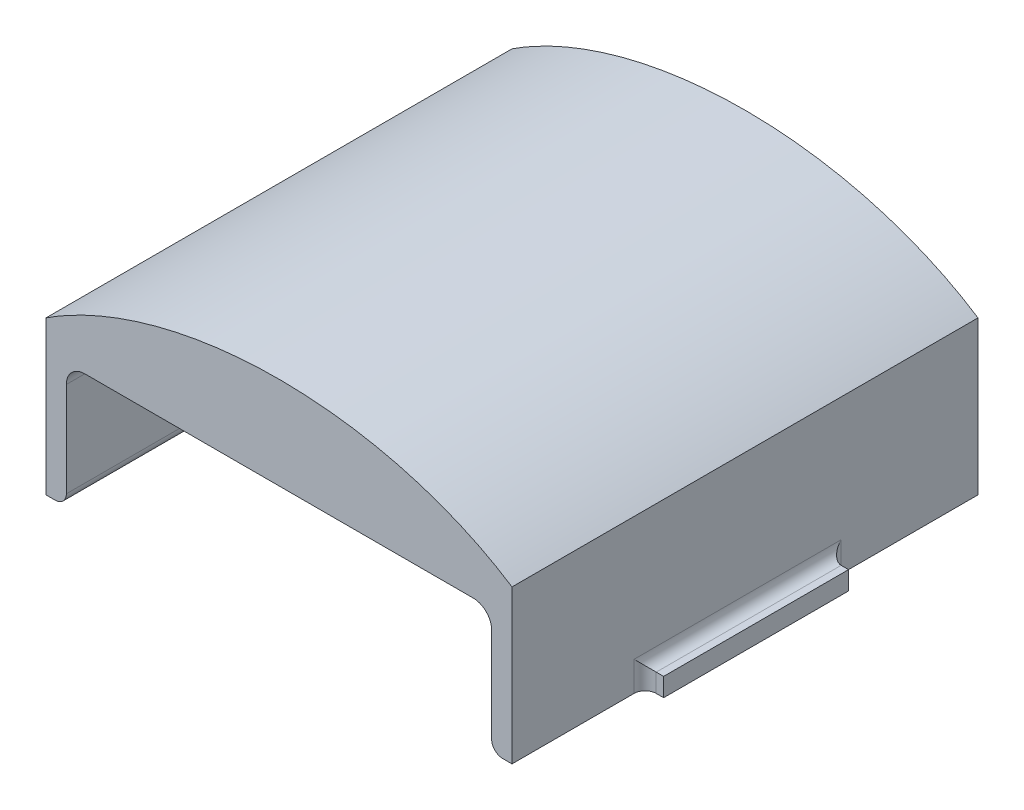
ISO-10303-21;
HEADER;
FILE_DESCRIPTION(('STEP AP214'),'2;1');
FILE_NAME('part.step','',(''),(''),'','','');
FILE_SCHEMA(('AUTOMOTIVE_DESIGN { 1 0 10303 214 1 1 1 1 }'));
ENDSEC;
DATA;
#1=APPLICATION_CONTEXT('core data for automotive mechanical design processes');
#2=APPLICATION_PROTOCOL_DEFINITION('international standard','automotive_design',2000,#1);
#3=PRODUCT_CONTEXT('',#1,'mechanical');
#4=PRODUCT('Part','Part','',(#3));
#5=PRODUCT_RELATED_PRODUCT_CATEGORY('part','',(#4));
#6=PRODUCT_DEFINITION_FORMATION('','',#4);
#7=PRODUCT_DEFINITION_CONTEXT('part definition',#1,'design');
#8=PRODUCT_DEFINITION('design','',#6,#7);
#9=PRODUCT_DEFINITION_SHAPE('','',#8);
#10=(LENGTH_UNIT() NAMED_UNIT(*) SI_UNIT(.MILLI.,.METRE.));
#11=(NAMED_UNIT(*) PLANE_ANGLE_UNIT() SI_UNIT($,.RADIAN.));
#12=(NAMED_UNIT(*) SI_UNIT($,.STERADIAN.) SOLID_ANGLE_UNIT());
#13=UNCERTAINTY_MEASURE_WITH_UNIT(LENGTH_MEASURE(1.E-05),#10,'distance_accuracy_value','');
#14=(GEOMETRIC_REPRESENTATION_CONTEXT(3) GLOBAL_UNCERTAINTY_ASSIGNED_CONTEXT((#13)) GLOBAL_UNIT_ASSIGNED_CONTEXT((#10,
#11,#12)) REPRESENTATION_CONTEXT('',''));
#15=CARTESIAN_POINT('',(0.,0.,0.));
#16=DIRECTION('',(0.,0.,1.));
#17=DIRECTION('',(1.,0.,0.));
#18=AXIS2_PLACEMENT_3D('',#15,#16,#17);
#19=CARTESIAN_POINT('',(-16.002,17.2485773582246,0.));
#20=DIRECTION('',(1.,0.,0.));
#21=DIRECTION('',(0.,1.,0.));
#22=AXIS2_PLACEMENT_3D('',#19,#20,#21);
#23=PLANE('',#22);
#24=DIRECTION('',(0.,0.,-1.));
#25=VECTOR('',#24,1.);
#26=CARTESIAN_POINT('',(-16.002,0.355599999999999,35.052));
#27=LINE('',#26,#25);
#28=CARTESIAN_POINT('',(-16.002,0.355599999999999,12.446));
#29=VERTEX_POINT('',#28);
#30=CARTESIAN_POINT('',(-16.002,0.355599999999999,3.048));
#31=VERTEX_POINT('',#30);
#32=EDGE_CURVE('E255',#29,#31,#27,.T.);
#33=ORIENTED_EDGE('',*,*,#32,.F.);
#34=DIRECTION('',(0.,-1.,0.));
#35=VECTOR('',#34,1.);
#36=CARTESIAN_POINT('',(-16.002,1.6256,12.446));
#37=LINE('',#36,#35);
#38=CARTESIAN_POINT('',(-16.002,2.3876,12.446));
#39=VERTEX_POINT('',#38);
#40=EDGE_CURVE('E413',#29,#39,#37,.F.);
#41=ORIENTED_EDGE('',*,*,#40,.T.);
#42=DIRECTION('',(0.,0.,-1.));
#43=VECTOR('',#42,1.);
#44=CARTESIAN_POINT('',(-16.002,2.3876,0.));
#45=LINE('',#44,#43);
#46=CARTESIAN_POINT('',(-16.002,2.3876,26.67));
#47=VERTEX_POINT('',#46);
#48=EDGE_CURVE('E411',#39,#47,#45,.F.);
#49=ORIENTED_EDGE('',*,*,#48,.T.);
#50=DIRECTION('',(0.,-1.,0.));
#51=VECTOR('',#50,1.);
#52=CARTESIAN_POINT('',(-16.002,17.2485773582246,26.67));
#53=LINE('',#52,#51);
#54=CARTESIAN_POINT('',(-16.002,0.355599999999999,26.67));
#55=VERTEX_POINT('',#54);
#56=EDGE_CURVE('E409',#47,#55,#53,.T.);
#57=ORIENTED_EDGE('',*,*,#56,.T.);
#58=CARTESIAN_POINT('',(-16.002,0.355599999999998,35.052));
#59=VERTEX_POINT('',#58);
#60=EDGE_CURVE('E264',#59,#55,#27,.T.);
#61=ORIENTED_EDGE('',*,*,#60,.F.);
#62=DIRECTION('',(0.,-1.,0.));
#63=VECTOR('',#62,1.);
#64=CARTESIAN_POINT('',(-16.002,17.2485773582246,35.052));
#65=LINE('',#64,#63);
#66=CARTESIAN_POINT('',(-16.002,10.8835369250993,35.052));
#67=VERTEX_POINT('',#66);
#68=EDGE_CURVE('E290',#67,#59,#65,.T.);
#69=ORIENTED_EDGE('',*,*,#68,.F.);
#70=DIRECTION('',(0.,0.,-1.));
#71=VECTOR('',#70,1.);
#72=CARTESIAN_POINT('',(-16.002,10.8835369250993,19.05));
#73=LINE('',#72,#71);
#74=CARTESIAN_POINT('',(-16.002,10.8835369250993,3.048));
#75=VERTEX_POINT('',#74);
#76=EDGE_CURVE('E275',#75,#67,#73,.F.);
#77=ORIENTED_EDGE('',*,*,#76,.F.);
#78=DIRECTION('',(0.,-1.,0.));
#79=VECTOR('',#78,1.);
#80=CARTESIAN_POINT('',(-16.002,17.2485773582246,3.048));
#81=LINE('',#80,#79);
#82=EDGE_CURVE('E287',#75,#31,#81,.T.);
#83=ORIENTED_EDGE('',*,*,#82,.T.);
#84=EDGE_LOOP('',(#33,#41,#49,#57,#61,#69,#77,#83));
#85=FACE_BOUND('',#84,.T.);
#86=ADVANCED_FACE('F34',(#85),#23,.F.);
#87=CARTESIAN_POINT('',(14.605,8.89,2.53999999999999));
#88=DIRECTION('',(0.,1.,0.));
#89=DIRECTION('',(-1.,0.,0.));
#90=AXIS2_PLACEMENT_3D('',#87,#88,#89);
#91=PLANE('',#90);
#92=DIRECTION('',(-1.,0.,0.));
#93=VECTOR('',#92,1.);
#94=CARTESIAN_POINT('',(14.605,8.89,35.052));
#95=LINE('',#94,#93);
#96=CARTESIAN_POINT('',(13.335,8.89,35.052));
#97=VERTEX_POINT('',#96);
#98=CARTESIAN_POINT('',(-13.335,8.89,35.052));
#99=VERTEX_POINT('',#98);
#100=EDGE_CURVE('E262',#97,#99,#95,.T.);
#101=ORIENTED_EDGE('',*,*,#100,.T.);
#102=DIRECTION('',(0.,0.,1.));
#103=VECTOR('',#102,1.);
#104=CARTESIAN_POINT('',(-13.335,8.89,3.048));
#105=LINE('',#104,#103);
#106=CARTESIAN_POINT('',(-13.335,8.89,3.048));
#107=VERTEX_POINT('',#106);
#108=EDGE_CURVE('E450',#99,#107,#105,.F.);
#109=ORIENTED_EDGE('',*,*,#108,.T.);
#110=DIRECTION('',(-1.,0.,0.));
#111=VECTOR('',#110,1.);
#112=CARTESIAN_POINT('',(14.605,8.89,3.048));
#113=LINE('',#112,#111);
#114=CARTESIAN_POINT('',(13.335,8.89,3.048));
#115=VERTEX_POINT('',#114);
#116=EDGE_CURVE('E268',#115,#107,#113,.T.);
#117=ORIENTED_EDGE('',*,*,#116,.F.);
#118=DIRECTION('',(0.,0.,1.));
#119=VECTOR('',#118,1.);
#120=CARTESIAN_POINT('',(13.335,8.89,35.052));
#121=LINE('',#120,#119);
#122=EDGE_CURVE('E447',#115,#97,#121,.T.);
#123=ORIENTED_EDGE('',*,*,#122,.T.);
#124=EDGE_LOOP('',(#101,#109,#117,#123));
#125=FACE_BOUND('',#124,.T.);
#126=ADVANCED_FACE('F311',(#125),#91,.F.);
#127=CARTESIAN_POINT('',(0.,0.,45.72));
#128=DIRECTION('',(0.,0.,1.));
#129=DIRECTION('',(-1.,0.,0.));
#130=AXIS2_PLACEMENT_3D('',#127,#128,#129);
#131=ELLIPSE('',#130,22.86,15.24);
#132=DIRECTION('',(0.,0.,-1.));
#133=VECTOR('',#132,1.);
#134=SURFACE_OF_LINEAR_EXTRUSION('',#131,#133);
#135=DIRECTION('',(0.,0.,-1.));
#136=VECTOR('',#135,1.);
#137=CARTESIAN_POINT('',(16.002,10.8835369250993,19.05));
#138=LINE('',#137,#136);
#139=CARTESIAN_POINT('',(16.002,10.8835369250993,3.048));
#140=VERTEX_POINT('',#139);
#141=CARTESIAN_POINT('',(16.002,10.8835369250993,35.052));
#142=VERTEX_POINT('',#141);
#143=EDGE_CURVE('E277',#140,#142,#138,.F.);
#144=ORIENTED_EDGE('',*,*,#143,.F.);
#145=CARTESIAN_POINT('',(0.,0.,3.048));
#146=DIRECTION('',(0.,0.,1.));
#147=DIRECTION('',(-1.,0.,0.));
#148=AXIS2_PLACEMENT_3D('',#145,#146,#147);
#149=ELLIPSE('',#148,22.86,15.24);
#150=EDGE_CURVE('E272',#140,#75,#149,.T.);
#151=ORIENTED_EDGE('',*,*,#150,.T.);
#152=ORIENTED_EDGE('',*,*,#76,.T.);
#153=CARTESIAN_POINT('',(0.,0.,35.052));
#154=DIRECTION('',(0.,0.,1.));
#155=DIRECTION('',(-1.,0.,0.));
#156=AXIS2_PLACEMENT_3D('',#153,#154,#155);
#157=ELLIPSE('',#156,22.86,15.24);
#158=EDGE_CURVE('E281',#142,#67,#157,.T.);
#159=ORIENTED_EDGE('',*,*,#158,.F.);
#160=EDGE_LOOP('',(#144,#151,#152,#159));
#161=FACE_BOUND('',#160,.T.);
#162=ADVANCED_FACE('F306',(#161),#134,.F.);
#163=CARTESIAN_POINT('',(-14.605,-8.89,2.53999999999999));
#164=DIRECTION('',(-1.,0.,0.));
#165=DIRECTION('',(0.,0.,1.));
#166=AXIS2_PLACEMENT_3D('',#163,#164,#165);
#167=PLANE('',#166);
#168=DIRECTION('',(0.,-1.,0.));
#169=VECTOR('',#168,1.);
#170=CARTESIAN_POINT('',(-14.605,17.2485773582246,3.048));
#171=LINE('',#170,#169);
#172=CARTESIAN_POINT('',(-14.605,7.62,3.048));
#173=VERTEX_POINT('',#172);
#174=CARTESIAN_POINT('',(-14.605,1.1176,3.048));
#175=VERTEX_POINT('',#174);
#176=EDGE_CURVE('E276',#173,#175,#171,.T.);
#177=ORIENTED_EDGE('',*,*,#176,.F.);
#178=DIRECTION('',(0.,0.,1.));
#179=VECTOR('',#178,1.);
#180=CARTESIAN_POINT('',(-14.605,7.62,35.052));
#181=LINE('',#180,#179);
#182=CARTESIAN_POINT('',(-14.605,7.62,35.052));
#183=VERTEX_POINT('',#182);
#184=EDGE_CURVE('E444',#173,#183,#181,.T.);
#185=ORIENTED_EDGE('',*,*,#184,.T.);
#186=DIRECTION('',(0.,-1.,0.));
#187=VECTOR('',#186,1.);
#188=CARTESIAN_POINT('',(-14.605,17.2485773582246,35.052));
#189=LINE('',#188,#187);
#190=CARTESIAN_POINT('',(-14.605,1.1176,35.052));
#191=VERTEX_POINT('',#190);
#192=EDGE_CURVE('E271',#183,#191,#189,.T.);
#193=ORIENTED_EDGE('',*,*,#192,.T.);
#194=DIRECTION('',(0.,0.,-1.));
#195=VECTOR('',#194,1.);
#196=CARTESIAN_POINT('',(-14.605,1.1176,2.53999999999999));
#197=LINE('',#196,#195);
#198=EDGE_CURVE('E439',#191,#175,#197,.T.);
#199=ORIENTED_EDGE('',*,*,#198,.T.);
#200=EDGE_LOOP('',(#177,#185,#193,#199));
#201=FACE_BOUND('',#200,.T.);
#202=ADVANCED_FACE('F310',(#201),#167,.F.);
#203=CARTESIAN_POINT('',(14.605,-8.89,2.53999999999999));
#204=DIRECTION('',(1.,0.,0.));
#205=DIRECTION('',(0.,0.,-1.));
#206=AXIS2_PLACEMENT_3D('',#203,#204,#205);
#207=PLANE('',#206);
#208=DIRECTION('',(0.,-1.,0.));
#209=VECTOR('',#208,1.);
#210=CARTESIAN_POINT('',(14.605,17.2485773582246,35.052));
#211=LINE('',#210,#209);
#212=CARTESIAN_POINT('',(14.605,7.62,35.052));
#213=VERTEX_POINT('',#212);
#214=CARTESIAN_POINT('',(14.605,1.1176,35.052));
#215=VERTEX_POINT('',#214);
#216=EDGE_CURVE('E280',#213,#215,#211,.T.);
#217=ORIENTED_EDGE('',*,*,#216,.F.);
#218=DIRECTION('',(0.,0.,1.));
#219=VECTOR('',#218,1.);
#220=CARTESIAN_POINT('',(14.605,7.62,3.048));
#221=LINE('',#220,#219);
#222=CARTESIAN_POINT('',(14.605,7.62,3.048));
#223=VERTEX_POINT('',#222);
#224=EDGE_CURVE('E55',#213,#223,#221,.F.);
#225=ORIENTED_EDGE('',*,*,#224,.T.);
#226=DIRECTION('',(0.,-1.,0.));
#227=VECTOR('',#226,1.);
#228=CARTESIAN_POINT('',(14.605,17.2485773582246,3.048));
#229=LINE('',#228,#227);
#230=CARTESIAN_POINT('',(14.605,1.1176,3.048));
#231=VERTEX_POINT('',#230);
#232=EDGE_CURVE('E283',#223,#231,#229,.T.);
#233=ORIENTED_EDGE('',*,*,#232,.T.);
#234=DIRECTION('',(0.,0.,1.));
#235=VECTOR('',#234,1.);
#236=CARTESIAN_POINT('',(14.605,1.1176,2.53999999999999));
#237=LINE('',#236,#235);
#238=EDGE_CURVE('E422',#231,#215,#237,.T.);
#239=ORIENTED_EDGE('',*,*,#238,.T.);
#240=EDGE_LOOP('',(#217,#225,#233,#239));
#241=FACE_BOUND('',#240,.T.);
#242=ADVANCED_FACE('F369',(#241),#207,.F.);
#243=CARTESIAN_POINT('',(0.,17.2485773582246,35.052));
#244=DIRECTION('',(0.,0.,1.));
#245=DIRECTION('',(1.,0.,0.));
#246=AXIS2_PLACEMENT_3D('',#243,#244,#245);
#247=PLANE('',#246);
#248=ORIENTED_EDGE('',*,*,#100,.F.);
#249=CARTESIAN_POINT('',(13.335,7.62,35.052));
#250=DIRECTION('',(0.,0.,1.));
#251=DIRECTION('',(1.,0.,0.));
#252=AXIS2_PLACEMENT_3D('',#249,#250,#251);
#253=CIRCLE('',#252,1.27);
#254=EDGE_CURVE('E42',#97,#213,#253,.F.);
#255=ORIENTED_EDGE('',*,*,#254,.T.);
#256=ORIENTED_EDGE('',*,*,#216,.T.);
#257=CARTESIAN_POINT('',(15.367,1.1176,35.052));
#258=DIRECTION('',(0.,0.,1.));
#259=DIRECTION('',(1.,0.,0.));
#260=AXIS2_PLACEMENT_3D('',#257,#258,#259);
#261=CIRCLE('',#260,0.762);
#262=CARTESIAN_POINT('',(15.367,0.355599999999999,35.052));
#263=VERTEX_POINT('',#262);
#264=EDGE_CURVE('E430',#215,#263,#261,.T.);
#265=ORIENTED_EDGE('',*,*,#264,.T.);
#266=DIRECTION('',(1.,0.,0.));
#267=VECTOR('',#266,1.);
#268=CARTESIAN_POINT('',(16.002,0.355599999999999,35.052));
#269=LINE('',#268,#267);
#270=CARTESIAN_POINT('',(16.002,0.355599999999999,35.052));
#271=VERTEX_POINT('',#270);
#272=EDGE_CURVE('E256',#263,#271,#269,.T.);
#273=ORIENTED_EDGE('',*,*,#272,.T.);
#274=DIRECTION('',(0.,-1.,0.));
#275=VECTOR('',#274,1.);
#276=CARTESIAN_POINT('',(16.002,17.2485773582246,35.052));
#277=LINE('',#276,#275);
#278=EDGE_CURVE('E279',#142,#271,#277,.T.);
#279=ORIENTED_EDGE('',*,*,#278,.F.);
#280=ORIENTED_EDGE('',*,*,#158,.T.);
#281=ORIENTED_EDGE('',*,*,#68,.T.);
#282=CARTESIAN_POINT('',(-15.367,0.355599999999999,35.052));
#283=VERTEX_POINT('',#282);
#284=EDGE_CURVE('E252',#59,#283,#269,.T.);
#285=ORIENTED_EDGE('',*,*,#284,.T.);
#286=CARTESIAN_POINT('',(-15.367,1.1176,35.052));
#287=DIRECTION('',(0.,0.,1.));
#288=DIRECTION('',(1.,0.,0.));
#289=AXIS2_PLACEMENT_3D('',#286,#287,#288);
#290=CIRCLE('',#289,0.762);
#291=EDGE_CURVE('E427',#283,#191,#290,.T.);
#292=ORIENTED_EDGE('',*,*,#291,.T.);
#293=ORIENTED_EDGE('',*,*,#192,.F.);
#294=CARTESIAN_POINT('',(-13.335,7.62,35.052));
#295=DIRECTION('',(0.,0.,1.));
#296=DIRECTION('',(1.,0.,0.));
#297=AXIS2_PLACEMENT_3D('',#294,#295,#296);
#298=CIRCLE('',#297,1.27);
#299=EDGE_CURVE('E453',#183,#99,#298,.F.);
#300=ORIENTED_EDGE('',*,*,#299,.T.);
#301=EDGE_LOOP('',(#248,#255,#256,#265,#273,#279,#280,#281,#285,#292,#293,#300));
#302=FACE_BOUND('',#301,.T.);
#303=ADVANCED_FACE('F366',(#302),#247,.T.);
#304=CARTESIAN_POINT('',(16.002,17.2485773582246,0.));
#305=DIRECTION('',(1.,0.,0.));
#306=DIRECTION('',(0.,1.,0.));
#307=AXIS2_PLACEMENT_3D('',#304,#305,#306);
#308=PLANE('',#307);
#309=DIRECTION('',(0.,0.,-1.));
#310=VECTOR('',#309,1.);
#311=CARTESIAN_POINT('',(16.002,2.3876,13.208));
#312=LINE('',#311,#310);
#313=CARTESIAN_POINT('',(16.002,2.3876,26.67));
#314=VERTEX_POINT('',#313);
#315=CARTESIAN_POINT('',(16.002,2.3876,12.446));
#316=VERTEX_POINT('',#315);
#317=EDGE_CURVE('E377',#314,#316,#312,.T.);
#318=ORIENTED_EDGE('',*,*,#317,.T.);
#319=DIRECTION('',(0.,1.,0.));
#320=VECTOR('',#319,1.);
#321=CARTESIAN_POINT('',(16.002,0.355599999999999,12.446));
#322=LINE('',#321,#320);
#323=CARTESIAN_POINT('',(16.002,0.355599999999999,12.446));
#324=VERTEX_POINT('',#323);
#325=EDGE_CURVE('E380',#316,#324,#322,.F.);
#326=ORIENTED_EDGE('',*,*,#325,.T.);
#327=DIRECTION('',(0.,0.,-1.));
#328=VECTOR('',#327,1.);
#329=CARTESIAN_POINT('',(16.002,0.355599999999999,35.052));
#330=LINE('',#329,#328);
#331=CARTESIAN_POINT('',(16.002,0.355599999999999,3.048));
#332=VERTEX_POINT('',#331);
#333=EDGE_CURVE('E263',#324,#332,#330,.T.);
#334=ORIENTED_EDGE('',*,*,#333,.T.);
#335=DIRECTION('',(0.,-1.,0.));
#336=VECTOR('',#335,1.);
#337=CARTESIAN_POINT('',(16.002,17.2485773582246,3.048));
#338=LINE('',#337,#336);
#339=EDGE_CURVE('E291',#140,#332,#338,.T.);
#340=ORIENTED_EDGE('',*,*,#339,.F.);
#341=ORIENTED_EDGE('',*,*,#143,.T.);
#342=ORIENTED_EDGE('',*,*,#278,.T.);
#343=CARTESIAN_POINT('',(16.002,0.355599999999999,26.67));
#344=VERTEX_POINT('',#343);
#345=EDGE_CURVE('E259',#271,#344,#330,.T.);
#346=ORIENTED_EDGE('',*,*,#345,.T.);
#347=DIRECTION('',(0.,1.,0.));
#348=VECTOR('',#347,1.);
#349=CARTESIAN_POINT('',(16.002,17.2485773582246,26.67));
#350=LINE('',#349,#348);
#351=EDGE_CURVE('E383',#344,#314,#350,.T.);
#352=ORIENTED_EDGE('',*,*,#351,.T.);
#353=EDGE_LOOP('',(#318,#326,#334,#340,#341,#342,#346,#352));
#354=FACE_BOUND('',#353,.T.);
#355=ADVANCED_FACE('F368',(#354),#308,.T.);
#356=CARTESIAN_POINT('',(0.,17.2485773582246,3.048));
#357=DIRECTION('',(0.,0.,1.));
#358=DIRECTION('',(1.,0.,0.));
#359=AXIS2_PLACEMENT_3D('',#356,#357,#358);
#360=PLANE('',#359);
#361=DIRECTION('',(1.,0.,0.));
#362=VECTOR('',#361,1.);
#363=CARTESIAN_POINT('',(16.002,0.355599999999999,3.048));
#364=LINE('',#363,#362);
#365=CARTESIAN_POINT('',(15.367,0.355599999999999,3.048));
#366=VERTEX_POINT('',#365);
#367=EDGE_CURVE('E249',#366,#332,#364,.T.);
#368=ORIENTED_EDGE('',*,*,#367,.F.);
#369=CARTESIAN_POINT('',(15.367,1.1176,3.048));
#370=DIRECTION('',(0.,0.,1.));
#371=DIRECTION('',(1.,0.,0.));
#372=AXIS2_PLACEMENT_3D('',#369,#370,#371);
#373=CIRCLE('',#372,0.762);
#374=EDGE_CURVE('E436',#366,#231,#373,.F.);
#375=ORIENTED_EDGE('',*,*,#374,.T.);
#376=ORIENTED_EDGE('',*,*,#232,.F.);
#377=CARTESIAN_POINT('',(13.335,7.62,3.048));
#378=DIRECTION('',(0.,0.,1.));
#379=DIRECTION('',(1.,0.,0.));
#380=AXIS2_PLACEMENT_3D('',#377,#378,#379);
#381=CIRCLE('',#380,1.27);
#382=EDGE_CURVE('E11',#223,#115,#381,.T.);
#383=ORIENTED_EDGE('',*,*,#382,.T.);
#384=ORIENTED_EDGE('',*,*,#116,.T.);
#385=CARTESIAN_POINT('',(-13.335,7.62,3.048));
#386=DIRECTION('',(0.,0.,1.));
#387=DIRECTION('',(1.,0.,0.));
#388=AXIS2_PLACEMENT_3D('',#385,#386,#387);
#389=CIRCLE('',#388,1.27);
#390=EDGE_CURVE('E455',#107,#173,#389,.T.);
#391=ORIENTED_EDGE('',*,*,#390,.T.);
#392=ORIENTED_EDGE('',*,*,#176,.T.);
#393=CARTESIAN_POINT('',(-15.367,1.1176,3.048));
#394=DIRECTION('',(0.,0.,1.));
#395=DIRECTION('',(1.,0.,0.));
#396=AXIS2_PLACEMENT_3D('',#393,#394,#395);
#397=CIRCLE('',#396,0.762);
#398=CARTESIAN_POINT('',(-15.367,0.355599999999999,3.048));
#399=VERTEX_POINT('',#398);
#400=EDGE_CURVE('E434',#175,#399,#397,.F.);
#401=ORIENTED_EDGE('',*,*,#400,.T.);
#402=EDGE_CURVE('E257',#31,#399,#364,.T.);
#403=ORIENTED_EDGE('',*,*,#402,.F.);
#404=ORIENTED_EDGE('',*,*,#82,.F.);
#405=ORIENTED_EDGE('',*,*,#150,.F.);
#406=ORIENTED_EDGE('',*,*,#339,.T.);
#407=EDGE_LOOP('',(#368,#375,#376,#383,#384,#391,#392,#401,#403,#404,#405,#406));
#408=FACE_BOUND('',#407,.T.);
#409=ADVANCED_FACE('F313',(#408),#360,.F.);
#410=CARTESIAN_POINT('',(16.002,0.355599999999999,35.052));
#411=DIRECTION('',(0.,1.,0.));
#412=DIRECTION('',(0.,0.,1.));
#413=AXIS2_PLACEMENT_3D('',#410,#411,#412);
#414=PLANE('',#413);
#415=ORIENTED_EDGE('',*,*,#402,.T.);
#416=DIRECTION('',(0.,0.,-1.));
#417=VECTOR('',#416,1.);
#418=CARTESIAN_POINT('',(-15.367,0.355599999999999,35.052));
#419=LINE('',#418,#417);
#420=EDGE_CURVE('E442',#399,#283,#419,.F.);
#421=ORIENTED_EDGE('',*,*,#420,.T.);
#422=ORIENTED_EDGE('',*,*,#284,.F.);
#423=ORIENTED_EDGE('',*,*,#60,.T.);
#424=CARTESIAN_POINT('',(-16.764,0.355600000000001,26.67));
#425=DIRECTION('',(0.,1.,0.));
#426=DIRECTION('',(0.,0.,1.));
#427=AXIS2_PLACEMENT_3D('',#424,#425,#426);
#428=CIRCLE('',#427,0.762);
#429=CARTESIAN_POINT('',(-16.764,0.355599999999999,25.908));
#430=VERTEX_POINT('',#429);
#431=EDGE_CURVE('E202',#55,#430,#428,.T.);
#432=ORIENTED_EDGE('',*,*,#431,.T.);
#433=DIRECTION('',(-1.,0.,0.));
#434=VECTOR('',#433,1.);
#435=CARTESIAN_POINT('',(-16.002,0.355599999999999,25.908));
#436=LINE('',#435,#434);
#437=CARTESIAN_POINT('',(-17.272,0.355599999999999,25.908));
#438=VERTEX_POINT('',#437);
#439=EDGE_CURVE('E193',#430,#438,#436,.T.);
#440=ORIENTED_EDGE('',*,*,#439,.T.);
#441=DIRECTION('',(0.,0.,-1.));
#442=VECTOR('',#441,1.);
#443=CARTESIAN_POINT('',(-17.272,0.355599999999999,25.908));
#444=LINE('',#443,#442);
#445=CARTESIAN_POINT('',(-17.272,0.355599999999999,13.208));
#446=VERTEX_POINT('',#445);
#447=EDGE_CURVE('E198',#438,#446,#444,.T.);
#448=ORIENTED_EDGE('',*,*,#447,.T.);
#449=DIRECTION('',(-1.,0.,0.));
#450=VECTOR('',#449,1.);
#451=CARTESIAN_POINT('',(-16.002,0.355599999999999,13.208));
#452=LINE('',#451,#450);
#453=CARTESIAN_POINT('',(-16.764,0.355599999999999,13.208));
#454=VERTEX_POINT('',#453);
#455=EDGE_CURVE('E223',#454,#446,#452,.T.);
#456=ORIENTED_EDGE('',*,*,#455,.F.);
#457=CARTESIAN_POINT('',(-16.764,0.355599999999999,12.446));
#458=DIRECTION('',(0.,1.,0.));
#459=DIRECTION('',(0.,0.,1.));
#460=AXIS2_PLACEMENT_3D('',#457,#458,#459);
#461=CIRCLE('',#460,0.762);
#462=EDGE_CURVE('E419',#454,#29,#461,.T.);
#463=ORIENTED_EDGE('',*,*,#462,.T.);
#464=ORIENTED_EDGE('',*,*,#32,.T.);
#465=EDGE_LOOP('',(#415,#421,#422,#423,#432,#440,#448,#456,#463,#464));
#466=FACE_BOUND('',#465,.T.);
#467=ADVANCED_FACE('F196',(#466),#414,.F.);
#468=ORIENTED_EDGE('',*,*,#272,.F.);
#469=DIRECTION('',(0.,0.,1.));
#470=VECTOR('',#469,1.);
#471=CARTESIAN_POINT('',(15.367,0.355599999999999,35.052));
#472=LINE('',#471,#470);
#473=EDGE_CURVE('E432',#263,#366,#472,.F.);
#474=ORIENTED_EDGE('',*,*,#473,.T.);
#475=ORIENTED_EDGE('',*,*,#367,.T.);
#476=ORIENTED_EDGE('',*,*,#333,.F.);
#477=CARTESIAN_POINT('',(16.764,0.355599999999999,12.446));
#478=DIRECTION('',(0.,1.,0.));
#479=DIRECTION('',(0.,0.,1.));
#480=AXIS2_PLACEMENT_3D('',#477,#478,#479);
#481=CIRCLE('',#480,0.762);
#482=CARTESIAN_POINT('',(16.764,0.355599999999999,13.208));
#483=VERTEX_POINT('',#482);
#484=EDGE_CURVE('E391',#324,#483,#481,.T.);
#485=ORIENTED_EDGE('',*,*,#484,.T.);
#486=DIRECTION('',(-1.,0.,0.));
#487=VECTOR('',#486,1.);
#488=CARTESIAN_POINT('',(16.002,0.355599999999999,13.208));
#489=LINE('',#488,#487);
#490=CARTESIAN_POINT('',(17.272,0.355599999999999,13.208));
#491=VERTEX_POINT('',#490);
#492=EDGE_CURVE('E234',#491,#483,#489,.T.);
#493=ORIENTED_EDGE('',*,*,#492,.F.);
#494=DIRECTION('',(0.,0.,-1.));
#495=VECTOR('',#494,1.);
#496=CARTESIAN_POINT('',(17.272,0.355599999999999,25.908));
#497=LINE('',#496,#495);
#498=CARTESIAN_POINT('',(17.272,0.355599999999999,25.908));
#499=VERTEX_POINT('',#498);
#500=EDGE_CURVE('E247',#499,#491,#497,.T.);
#501=ORIENTED_EDGE('',*,*,#500,.F.);
#502=DIRECTION('',(-1.,0.,0.));
#503=VECTOR('',#502,1.);
#504=CARTESIAN_POINT('',(16.002,0.355599999999999,25.908));
#505=LINE('',#504,#503);
#506=CARTESIAN_POINT('',(16.764,0.355599999999999,25.908));
#507=VERTEX_POINT('',#506);
#508=EDGE_CURVE('E237',#499,#507,#505,.T.);
#509=ORIENTED_EDGE('',*,*,#508,.T.);
#510=CARTESIAN_POINT('',(16.764,0.355600000000001,26.67));
#511=DIRECTION('',(0.,1.,0.));
#512=DIRECTION('',(0.,0.,1.));
#513=AXIS2_PLACEMENT_3D('',#510,#511,#512);
#514=CIRCLE('',#513,0.762);
#515=EDGE_CURVE('E403',#507,#344,#514,.T.);
#516=ORIENTED_EDGE('',*,*,#515,.T.);
#517=ORIENTED_EDGE('',*,*,#345,.F.);
#518=EDGE_LOOP('',(#468,#474,#475,#476,#485,#493,#501,#509,#516,#517));
#519=FACE_BOUND('',#518,.T.);
#520=ADVANCED_FACE('F475',(#519),#414,.F.);
#521=CARTESIAN_POINT('',(17.272,0.355599999999999,25.908));
#522=DIRECTION('',(1.,0.,0.));
#523=DIRECTION('',(0.,0.,-1.));
#524=AXIS2_PLACEMENT_3D('',#521,#522,#523);
#525=PLANE('',#524);
#526=DIRECTION('',(0.,-1.,0.));
#527=VECTOR('',#526,1.);
#528=CARTESIAN_POINT('',(17.272,0.355599999999999,13.208));
#529=LINE('',#528,#527);
#530=CARTESIAN_POINT('',(17.272,1.6256,13.208));
#531=VERTEX_POINT('',#530);
#532=EDGE_CURVE('E242',#531,#491,#529,.T.);
#533=ORIENTED_EDGE('',*,*,#532,.F.);
#534=DIRECTION('',(0.,0.,-1.));
#535=VECTOR('',#534,1.);
#536=CARTESIAN_POINT('',(17.272,1.6256,25.908));
#537=LINE('',#536,#535);
#538=CARTESIAN_POINT('',(17.272,1.6256,25.908));
#539=VERTEX_POINT('',#538);
#540=EDGE_CURVE('E240',#539,#531,#537,.T.);
#541=ORIENTED_EDGE('',*,*,#540,.F.);
#542=DIRECTION('',(0.,-1.,0.));
#543=VECTOR('',#542,1.);
#544=CARTESIAN_POINT('',(17.272,0.355599999999999,25.908));
#545=LINE('',#544,#543);
#546=EDGE_CURVE('E233',#539,#499,#545,.T.);
#547=ORIENTED_EDGE('',*,*,#546,.T.);
#548=ORIENTED_EDGE('',*,*,#500,.T.);
#549=EDGE_LOOP('',(#533,#541,#547,#548));
#550=FACE_BOUND('',#549,.T.);
#551=ADVANCED_FACE('F517',(#550),#525,.T.);
#552=CARTESIAN_POINT('',(16.002,1.6256,25.908));
#553=DIRECTION('',(0.,1.,0.));
#554=DIRECTION('',(-1.,0.,0.));
#555=AXIS2_PLACEMENT_3D('',#552,#553,#554);
#556=PLANE('',#555);
#557=DIRECTION('',(1.,0.,0.));
#558=VECTOR('',#557,1.);
#559=CARTESIAN_POINT('',(16.002,1.6256,13.208));
#560=LINE('',#559,#558);
#561=CARTESIAN_POINT('',(16.764,1.6256,13.208));
#562=VERTEX_POINT('',#561);
#563=EDGE_CURVE('E229',#562,#531,#560,.T.);
#564=ORIENTED_EDGE('',*,*,#563,.F.);
#565=DIRECTION('',(0.,0.,-1.));
#566=VECTOR('',#565,1.);
#567=CARTESIAN_POINT('',(16.764,1.6256,25.908));
#568=LINE('',#567,#566);
#569=CARTESIAN_POINT('',(16.764,1.6256,25.908));
#570=VERTEX_POINT('',#569);
#571=EDGE_CURVE('E394',#562,#570,#568,.F.);
#572=ORIENTED_EDGE('',*,*,#571,.T.);
#573=DIRECTION('',(1.,0.,0.));
#574=VECTOR('',#573,1.);
#575=CARTESIAN_POINT('',(16.002,1.6256,25.908));
#576=LINE('',#575,#574);
#577=EDGE_CURVE('E231',#570,#539,#576,.T.);
#578=ORIENTED_EDGE('',*,*,#577,.T.);
#579=ORIENTED_EDGE('',*,*,#540,.T.);
#580=EDGE_LOOP('',(#564,#572,#578,#579));
#581=FACE_BOUND('',#580,.T.);
#582=ADVANCED_FACE('F512',(#581),#556,.T.);
#583=CARTESIAN_POINT('',(0.,0.,25.908));
#584=DIRECTION('',(0.,0.,-1.));
#585=DIRECTION('',(-1.,0.,0.));
#586=AXIS2_PLACEMENT_3D('',#583,#584,#585);
#587=PLANE('',#586);
#588=ORIENTED_EDGE('',*,*,#577,.F.);
#589=DIRECTION('',(0.,1.,0.));
#590=VECTOR('',#589,1.);
#591=CARTESIAN_POINT('',(16.764,0.,25.908));
#592=LINE('',#591,#590);
#593=EDGE_CURVE('E392',#570,#507,#592,.F.);
#594=ORIENTED_EDGE('',*,*,#593,.T.);
#595=ORIENTED_EDGE('',*,*,#508,.F.);
#596=ORIENTED_EDGE('',*,*,#546,.F.);
#597=EDGE_LOOP('',(#588,#594,#595,#596));
#598=FACE_BOUND('',#597,.T.);
#599=ADVANCED_FACE('F509',(#598),#587,.F.);
#600=CARTESIAN_POINT('',(0.,0.,13.208));
#601=DIRECTION('',(0.,0.,-1.));
#602=DIRECTION('',(-1.,0.,0.));
#603=AXIS2_PLACEMENT_3D('',#600,#601,#602);
#604=PLANE('',#603);
#605=ORIENTED_EDGE('',*,*,#492,.T.);
#606=DIRECTION('',(0.,1.,0.));
#607=VECTOR('',#606,1.);
#608=CARTESIAN_POINT('',(16.764,1.6256,13.208));
#609=LINE('',#608,#607);
#610=EDGE_CURVE('E286',#483,#562,#609,.T.);
#611=ORIENTED_EDGE('',*,*,#610,.T.);
#612=ORIENTED_EDGE('',*,*,#563,.T.);
#613=ORIENTED_EDGE('',*,*,#532,.T.);
#614=EDGE_LOOP('',(#605,#611,#612,#613));
#615=FACE_BOUND('',#614,.T.);
#616=ADVANCED_FACE('F506',(#615),#604,.T.);
#617=CARTESIAN_POINT('',(-16.002,1.6256,25.908));
#618=DIRECTION('',(0.,1.,0.));
#619=DIRECTION('',(0.,0.,1.));
#620=AXIS2_PLACEMENT_3D('',#617,#618,#619);
#621=PLANE('',#620);
#622=DIRECTION('',(1.,0.,0.));
#623=VECTOR('',#622,1.);
#624=CARTESIAN_POINT('',(-16.002,1.6256,25.908));
#625=LINE('',#624,#623);
#626=CARTESIAN_POINT('',(-17.272,1.6256,25.908));
#627=VERTEX_POINT('',#626);
#628=CARTESIAN_POINT('',(-16.764,1.6256,25.908));
#629=VERTEX_POINT('',#628);
#630=EDGE_CURVE('E216',#627,#629,#625,.T.);
#631=ORIENTED_EDGE('',*,*,#630,.T.);
#632=DIRECTION('',(0.,0.,-1.));
#633=VECTOR('',#632,1.);
#634=CARTESIAN_POINT('',(-16.764,1.6256,25.908));
#635=LINE('',#634,#633);
#636=CARTESIAN_POINT('',(-16.764,1.6256,13.208));
#637=VERTEX_POINT('',#636);
#638=EDGE_CURVE('E415',#629,#637,#635,.T.);
#639=ORIENTED_EDGE('',*,*,#638,.T.);
#640=DIRECTION('',(1.,0.,0.));
#641=VECTOR('',#640,1.);
#642=CARTESIAN_POINT('',(-16.002,1.6256,13.208));
#643=LINE('',#642,#641);
#644=CARTESIAN_POINT('',(-17.272,1.6256,13.208));
#645=VERTEX_POINT('',#644);
#646=EDGE_CURVE('E207',#645,#637,#643,.T.);
#647=ORIENTED_EDGE('',*,*,#646,.F.);
#648=DIRECTION('',(0.,0.,-1.));
#649=VECTOR('',#648,1.);
#650=CARTESIAN_POINT('',(-17.272,1.6256,25.908));
#651=LINE('',#650,#649);
#652=EDGE_CURVE('E215',#627,#645,#651,.T.);
#653=ORIENTED_EDGE('',*,*,#652,.F.);
#654=EDGE_LOOP('',(#631,#639,#647,#653));
#655=FACE_BOUND('',#654,.T.);
#656=ADVANCED_FACE('F494',(#655),#621,.T.);
#657=CARTESIAN_POINT('',(-17.272,0.355599999999999,25.908));
#658=DIRECTION('',(-1.,0.,0.));
#659=DIRECTION('',(0.,0.,1.));
#660=AXIS2_PLACEMENT_3D('',#657,#658,#659);
#661=PLANE('',#660);
#662=DIRECTION('',(0.,1.,0.));
#663=VECTOR('',#662,1.);
#664=CARTESIAN_POINT('',(-17.272,0.355599999999999,13.208));
#665=LINE('',#664,#663);
#666=EDGE_CURVE('E214',#446,#645,#665,.T.);
#667=ORIENTED_EDGE('',*,*,#666,.F.);
#668=ORIENTED_EDGE('',*,*,#447,.F.);
#669=DIRECTION('',(0.,1.,0.));
#670=VECTOR('',#669,1.);
#671=CARTESIAN_POINT('',(-17.272,0.355599999999999,25.908));
#672=LINE('',#671,#670);
#673=EDGE_CURVE('E206',#438,#627,#672,.T.);
#674=ORIENTED_EDGE('',*,*,#673,.T.);
#675=ORIENTED_EDGE('',*,*,#652,.T.);
#676=EDGE_LOOP('',(#667,#668,#674,#675));
#677=FACE_BOUND('',#676,.T.);
#678=ADVANCED_FACE('F211',(#677),#661,.T.);
#679=CARTESIAN_POINT('',(0.,0.,25.908));
#680=DIRECTION('',(0.,0.,1.));
#681=DIRECTION('',(1.,0.,0.));
#682=AXIS2_PLACEMENT_3D('',#679,#680,#681);
#683=PLANE('',#682);
#684=ORIENTED_EDGE('',*,*,#439,.F.);
#685=DIRECTION('',(0.,-1.,0.));
#686=VECTOR('',#685,1.);
#687=CARTESIAN_POINT('',(-16.764,0.,25.908));
#688=LINE('',#687,#686);
#689=EDGE_CURVE('E417',#430,#629,#688,.F.);
#690=ORIENTED_EDGE('',*,*,#689,.T.);
#691=ORIENTED_EDGE('',*,*,#630,.F.);
#692=ORIENTED_EDGE('',*,*,#673,.F.);
#693=EDGE_LOOP('',(#684,#690,#691,#692));
#694=FACE_BOUND('',#693,.T.);
#695=ADVANCED_FACE('F218',(#694),#683,.T.);
#696=CARTESIAN_POINT('',(0.,0.,13.208));
#697=DIRECTION('',(0.,0.,1.));
#698=DIRECTION('',(1.,0.,0.));
#699=AXIS2_PLACEMENT_3D('',#696,#697,#698);
#700=PLANE('',#699);
#701=ORIENTED_EDGE('',*,*,#646,.T.);
#702=DIRECTION('',(0.,-1.,0.));
#703=VECTOR('',#702,1.);
#704=CARTESIAN_POINT('',(-16.764,0.355599999999999,13.208));
#705=LINE('',#704,#703);
#706=EDGE_CURVE('E406',#637,#454,#705,.T.);
#707=ORIENTED_EDGE('',*,*,#706,.T.);
#708=ORIENTED_EDGE('',*,*,#455,.T.);
#709=ORIENTED_EDGE('',*,*,#666,.T.);
#710=EDGE_LOOP('',(#701,#707,#708,#709));
#711=FACE_BOUND('',#710,.T.);
#712=ADVANCED_FACE('F327',(#711),#700,.F.);
#713=CARTESIAN_POINT('',(16.764,17.2485773582246,26.67));
#714=DIRECTION('',(0.,1.,0.));
#715=DIRECTION('',(-1.,0.,0.));
#716=AXIS2_PLACEMENT_3D('',#713,#714,#715);
#717=CYLINDRICAL_SURFACE('',#716,0.762);
#718=ORIENTED_EDGE('',*,*,#515,.F.);
#719=ORIENTED_EDGE('',*,*,#593,.F.);
#720=CARTESIAN_POINT('',(16.764,2.3876,26.67));
#721=DIRECTION('',(0.,-0.707106781186547,0.707106781186547));
#722=DIRECTION('',(0.,0.707106781186547,0.707106781186547));
#723=AXIS2_PLACEMENT_3D('',#720,#721,#722);
#724=ELLIPSE('',#723,1.0776307345283,0.762);
#725=EDGE_CURVE('E225',#314,#570,#724,.T.);
#726=ORIENTED_EDGE('',*,*,#725,.F.);
#727=ORIENTED_EDGE('',*,*,#351,.F.);
#728=EDGE_LOOP('',(#718,#719,#726,#727));
#729=FACE_BOUND('',#728,.T.);
#730=ADVANCED_FACE('F323',(#729),#717,.F.);
#731=CARTESIAN_POINT('',(16.764,2.3876,0.));
#732=DIRECTION('',(0.,0.,1.));
#733=DIRECTION('',(0.,-1.,0.));
#734=AXIS2_PLACEMENT_3D('',#731,#732,#733);
#735=CYLINDRICAL_SURFACE('',#734,0.762);
#736=ORIENTED_EDGE('',*,*,#725,.T.);
#737=ORIENTED_EDGE('',*,*,#571,.F.);
#738=CARTESIAN_POINT('',(16.764,2.3876,12.446));
#739=DIRECTION('',(0.,0.707106781186547,0.707106781186547));
#740=DIRECTION('',(0.,-0.707106781186547,0.707106781186547));
#741=AXIS2_PLACEMENT_3D('',#738,#739,#740);
#742=ELLIPSE('',#741,1.0776307345283,0.762);
#743=EDGE_CURVE('E389',#316,#562,#742,.T.);
#744=ORIENTED_EDGE('',*,*,#743,.F.);
#745=ORIENTED_EDGE('',*,*,#317,.F.);
#746=EDGE_LOOP('',(#736,#737,#744,#745));
#747=FACE_BOUND('',#746,.T.);
#748=ADVANCED_FACE('F319',(#747),#735,.F.);
#749=CARTESIAN_POINT('',(16.764,0.,12.446));
#750=DIRECTION('',(0.,-1.,0.));
#751=DIRECTION('',(1.,0.,0.));
#752=AXIS2_PLACEMENT_3D('',#749,#750,#751);
#753=CYLINDRICAL_SURFACE('',#752,0.762);
#754=ORIENTED_EDGE('',*,*,#484,.F.);
#755=ORIENTED_EDGE('',*,*,#325,.F.);
#756=ORIENTED_EDGE('',*,*,#743,.T.);
#757=ORIENTED_EDGE('',*,*,#610,.F.);
#758=EDGE_LOOP('',(#754,#755,#756,#757));
#759=FACE_BOUND('',#758,.T.);
#760=ADVANCED_FACE('F315',(#759),#753,.F.);
#761=CARTESIAN_POINT('',(-16.764,17.2485773582246,26.67));
#762=DIRECTION('',(0.,-1.,0.));
#763=DIRECTION('',(1.,0.,0.));
#764=AXIS2_PLACEMENT_3D('',#761,#762,#763);
#765=CYLINDRICAL_SURFACE('',#764,0.762);
#766=ORIENTED_EDGE('',*,*,#431,.F.);
#767=ORIENTED_EDGE('',*,*,#56,.F.);
#768=CARTESIAN_POINT('',(-16.764,2.3876,26.67));
#769=DIRECTION('',(0.,-0.707106781186547,0.707106781186547));
#770=DIRECTION('',(0.,-0.707106781186547,-0.707106781186547));
#771=AXIS2_PLACEMENT_3D('',#768,#769,#770);
#772=ELLIPSE('',#771,1.0776307345283,0.762);
#773=EDGE_CURVE('E396',#629,#47,#772,.T.);
#774=ORIENTED_EDGE('',*,*,#773,.F.);
#775=ORIENTED_EDGE('',*,*,#689,.F.);
#776=EDGE_LOOP('',(#766,#767,#774,#775));
#777=FACE_BOUND('',#776,.T.);
#778=ADVANCED_FACE('F318',(#777),#765,.F.);
#779=CARTESIAN_POINT('',(-16.764,2.3876,25.908));
#780=DIRECTION('',(0.,0.,-1.));
#781=DIRECTION('',(0.,1.,0.));
#782=AXIS2_PLACEMENT_3D('',#779,#780,#781);
#783=CYLINDRICAL_SURFACE('',#782,0.762);
#784=ORIENTED_EDGE('',*,*,#773,.T.);
#785=ORIENTED_EDGE('',*,*,#48,.F.);
#786=CARTESIAN_POINT('',(-16.764,2.3876,12.446));
#787=DIRECTION('',(0.,-0.707106781186547,-0.707106781186547));
#788=DIRECTION('',(0.,0.707106781186547,-0.707106781186547));
#789=AXIS2_PLACEMENT_3D('',#786,#787,#788);
#790=ELLIPSE('',#789,1.0776307345283,0.762);
#791=EDGE_CURVE('E400',#637,#39,#790,.F.);
#792=ORIENTED_EDGE('',*,*,#791,.F.);
#793=ORIENTED_EDGE('',*,*,#638,.F.);
#794=EDGE_LOOP('',(#784,#785,#792,#793));
#795=FACE_BOUND('',#794,.T.);
#796=ADVANCED_FACE('F333',(#795),#783,.F.);
#797=CARTESIAN_POINT('',(-16.764,0.,12.446));
#798=DIRECTION('',(0.,1.,0.));
#799=DIRECTION('',(-1.,0.,0.));
#800=AXIS2_PLACEMENT_3D('',#797,#798,#799);
#801=CYLINDRICAL_SURFACE('',#800,0.762);
#802=ORIENTED_EDGE('',*,*,#791,.T.);
#803=ORIENTED_EDGE('',*,*,#40,.F.);
#804=ORIENTED_EDGE('',*,*,#462,.F.);
#805=ORIENTED_EDGE('',*,*,#706,.F.);
#806=EDGE_LOOP('',(#802,#803,#804,#805));
#807=FACE_BOUND('',#806,.T.);
#808=ADVANCED_FACE('F329',(#807),#801,.F.);
#809=CARTESIAN_POINT('',(15.367,1.1176,2.53999999999999));
#810=DIRECTION('',(0.,0.,1.));
#811=DIRECTION('',(0.,-1.,0.));
#812=AXIS2_PLACEMENT_3D('',#809,#810,#811);
#813=CYLINDRICAL_SURFACE('',#812,0.762);
#814=ORIENTED_EDGE('',*,*,#374,.F.);
#815=ORIENTED_EDGE('',*,*,#473,.F.);
#816=ORIENTED_EDGE('',*,*,#264,.F.);
#817=ORIENTED_EDGE('',*,*,#238,.F.);
#818=EDGE_LOOP('',(#814,#815,#816,#817));
#819=FACE_BOUND('',#818,.T.);
#820=ADVANCED_FACE('F332',(#819),#813,.T.);
#821=CARTESIAN_POINT('',(-15.367,1.1176,2.53999999999999));
#822=DIRECTION('',(0.,0.,-1.));
#823=DIRECTION('',(0.,1.,0.));
#824=AXIS2_PLACEMENT_3D('',#821,#822,#823);
#825=CYLINDRICAL_SURFACE('',#824,0.762);
#826=ORIENTED_EDGE('',*,*,#291,.F.);
#827=ORIENTED_EDGE('',*,*,#420,.F.);
#828=ORIENTED_EDGE('',*,*,#400,.F.);
#829=ORIENTED_EDGE('',*,*,#198,.F.);
#830=EDGE_LOOP('',(#826,#827,#828,#829));
#831=FACE_BOUND('',#830,.T.);
#832=ADVANCED_FACE('F343',(#831),#825,.T.);
#833=CARTESIAN_POINT('',(-13.335,7.62,2.53999999999999));
#834=DIRECTION('',(0.,0.,-1.));
#835=DIRECTION('',(-1.,0.,0.));
#836=AXIS2_PLACEMENT_3D('',#833,#834,#835);
#837=CYLINDRICAL_SURFACE('',#836,1.27);
#838=ORIENTED_EDGE('',*,*,#390,.F.);
#839=ORIENTED_EDGE('',*,*,#108,.F.);
#840=ORIENTED_EDGE('',*,*,#299,.F.);
#841=ORIENTED_EDGE('',*,*,#184,.F.);
#842=EDGE_LOOP('',(#838,#839,#840,#841));
#843=FACE_BOUND('',#842,.T.);
#844=ADVANCED_FACE('F346',(#843),#837,.F.);
#845=CARTESIAN_POINT('',(13.335,7.62,2.53999999999999));
#846=DIRECTION('',(0.,0.,-1.));
#847=DIRECTION('',(-1.,0.,0.));
#848=AXIS2_PLACEMENT_3D('',#845,#846,#847);
#849=CYLINDRICAL_SURFACE('',#848,1.27);
#850=ORIENTED_EDGE('',*,*,#382,.F.);
#851=ORIENTED_EDGE('',*,*,#224,.F.);
#852=ORIENTED_EDGE('',*,*,#254,.F.);
#853=ORIENTED_EDGE('',*,*,#122,.F.);
#854=EDGE_LOOP('',(#850,#851,#852,#853));
#855=FACE_BOUND('',#854,.T.);
#856=ADVANCED_FACE('F36',(#855),#849,.F.);
#857=CLOSED_SHELL('',(#86,#126,#162,#202,#242,#303,#355,#409,#467,#520,#551,#582,#599,#616,#656,
#678,#695,#712,#730,#748,#760,#778,#796,#808,#820,#832,#844,#856));
#858=MANIFOLD_SOLID_BREP('B2',#857);
#859=ADVANCED_BREP_SHAPE_REPRESENTATION('',(#18,#858),#14);
#860=SHAPE_DEFINITION_REPRESENTATION(#9,#859);
ENDSEC;
END-ISO-10303-21;
